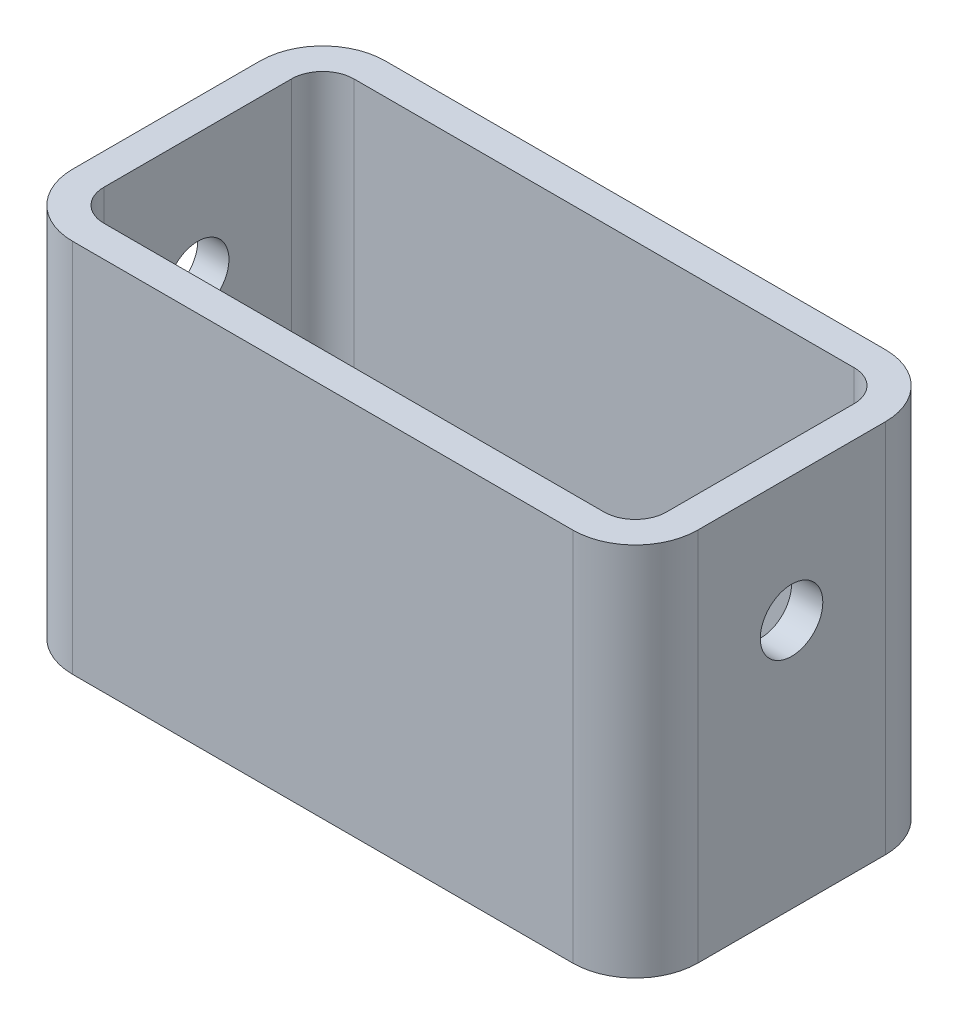
ISO-10303-21;
HEADER;
FILE_DESCRIPTION(('STEP AP214'),'2;1');
FILE_NAME('part.step','',(''),(''),'','','');
FILE_SCHEMA(('AUTOMOTIVE_DESIGN { 1 0 10303 214 1 1 1 1 }'));
ENDSEC;
DATA;
#1=APPLICATION_CONTEXT('core data for automotive mechanical design processes');
#2=APPLICATION_PROTOCOL_DEFINITION('international standard','automotive_design',2000,#1);
#3=PRODUCT_CONTEXT('',#1,'mechanical');
#4=PRODUCT('Part','Part','',(#3));
#5=PRODUCT_RELATED_PRODUCT_CATEGORY('part','',(#4));
#6=PRODUCT_DEFINITION_FORMATION('','',#4);
#7=PRODUCT_DEFINITION_CONTEXT('part definition',#1,'design');
#8=PRODUCT_DEFINITION('design','',#6,#7);
#9=PRODUCT_DEFINITION_SHAPE('','',#8);
#10=(LENGTH_UNIT() NAMED_UNIT(*) SI_UNIT(.MILLI.,.METRE.));
#11=(NAMED_UNIT(*) PLANE_ANGLE_UNIT() SI_UNIT($,.RADIAN.));
#12=(NAMED_UNIT(*) SI_UNIT($,.STERADIAN.) SOLID_ANGLE_UNIT());
#13=UNCERTAINTY_MEASURE_WITH_UNIT(LENGTH_MEASURE(1.E-05),#10,'distance_accuracy_value','');
#14=(GEOMETRIC_REPRESENTATION_CONTEXT(3) GLOBAL_UNCERTAINTY_ASSIGNED_CONTEXT((#13)) GLOBAL_UNIT_ASSIGNED_CONTEXT((#10,
#11,#12)) REPRESENTATION_CONTEXT('',''));
#15=CARTESIAN_POINT('',(0.,0.,0.));
#16=DIRECTION('',(0.,0.,1.));
#17=DIRECTION('',(1.,0.,0.));
#18=AXIS2_PLACEMENT_3D('',#15,#16,#17);
#19=CARTESIAN_POINT('',(-134.464065935856,-62.6480307201147,50.));
#20=DIRECTION('',(0.,-1.,0.));
#21=DIRECTION('',(0.,0.,-1.));
#22=AXIS2_PLACEMENT_3D('',#19,#20,#21);
#23=PLANE('',#22);
#24=DIRECTION('',(0.,0.,-1.));
#25=VECTOR('',#24,1.);
#26=CARTESIAN_POINT('',(-34.4640659358559,-62.6480307201147,50.));
#27=LINE('',#26,#25);
#28=CARTESIAN_POINT('',(-34.4640659358559,-62.6480307201147,40.));
#29=VERTEX_POINT('',#28);
#30=CARTESIAN_POINT('',(-34.4640659358559,-62.6480307201147,10.));
#31=VERTEX_POINT('',#30);
#32=EDGE_CURVE('E227',#29,#31,#27,.T.);
#33=ORIENTED_EDGE('',*,*,#32,.T.);
#34=CARTESIAN_POINT('',(-44.4640659358559,-62.6480307201147,10.));
#35=DIRECTION('',(0.,-1.,0.));
#36=DIRECTION('',(0.,0.,-1.));
#37=AXIS2_PLACEMENT_3D('',#34,#35,#36);
#38=CIRCLE('',#37,10.);
#39=CARTESIAN_POINT('',(-44.4640659358559,-62.6480307201147,0.));
#40=VERTEX_POINT('',#39);
#41=EDGE_CURVE('E247',#31,#40,#38,.F.);
#42=ORIENTED_EDGE('',*,*,#41,.T.);
#43=DIRECTION('',(-1.,0.,0.));
#44=VECTOR('',#43,1.);
#45=CARTESIAN_POINT('',(-134.464065935856,-62.6480307201147,0.));
#46=LINE('',#45,#44);
#47=CARTESIAN_POINT('',(-124.464065935856,-62.6480307201147,0.));
#48=VERTEX_POINT('',#47);
#49=EDGE_CURVE('E217',#40,#48,#46,.T.);
#50=ORIENTED_EDGE('',*,*,#49,.T.);
#51=CARTESIAN_POINT('',(-124.464065935856,-62.6480307201147,10.));
#52=DIRECTION('',(0.,-1.,0.));
#53=DIRECTION('',(0.,0.,-1.));
#54=AXIS2_PLACEMENT_3D('',#51,#52,#53);
#55=CIRCLE('',#54,10.);
#56=CARTESIAN_POINT('',(-134.464065935856,-62.6480307201147,10.));
#57=VERTEX_POINT('',#56);
#58=EDGE_CURVE('E245',#48,#57,#55,.F.);
#59=ORIENTED_EDGE('',*,*,#58,.T.);
#60=DIRECTION('',(0.,0.,-1.));
#61=VECTOR('',#60,1.);
#62=CARTESIAN_POINT('',(-134.464065935856,-62.6480307201147,50.));
#63=LINE('',#62,#61);
#64=CARTESIAN_POINT('',(-134.464065935856,-62.6480307201147,40.));
#65=VERTEX_POINT('',#64);
#66=EDGE_CURVE('E220',#65,#57,#63,.T.);
#67=ORIENTED_EDGE('',*,*,#66,.F.);
#68=CARTESIAN_POINT('',(-124.464065935856,-62.6480307201147,40.));
#69=DIRECTION('',(0.,-1.,0.));
#70=DIRECTION('',(0.,0.,-1.));
#71=AXIS2_PLACEMENT_3D('',#68,#69,#70);
#72=CIRCLE('',#71,10.);
#73=CARTESIAN_POINT('',(-124.464065935856,-62.6480307201147,50.));
#74=VERTEX_POINT('',#73);
#75=EDGE_CURVE('E243',#65,#74,#72,.F.);
#76=ORIENTED_EDGE('',*,*,#75,.T.);
#77=DIRECTION('',(-1.,0.,0.));
#78=VECTOR('',#77,1.);
#79=CARTESIAN_POINT('',(-134.464065935856,-62.6480307201147,50.));
#80=LINE('',#79,#78);
#81=CARTESIAN_POINT('',(-44.4640659358559,-62.6480307201147,50.));
#82=VERTEX_POINT('',#81);
#83=EDGE_CURVE('E216',#82,#74,#80,.T.);
#84=ORIENTED_EDGE('',*,*,#83,.F.);
#85=CARTESIAN_POINT('',(-44.4640659358559,-62.6480307201147,40.));
#86=DIRECTION('',(0.,-1.,0.));
#87=DIRECTION('',(0.,0.,-1.));
#88=AXIS2_PLACEMENT_3D('',#85,#86,#87);
#89=CIRCLE('',#88,10.);
#90=EDGE_CURVE('E241',#82,#29,#89,.F.);
#91=ORIENTED_EDGE('',*,*,#90,.T.);
#92=EDGE_LOOP('',(#33,#42,#50,#59,#67,#76,#84,#91));
#93=FACE_BOUND('',#92,.T.);
#94=DIRECTION('',(0.,0.,-1.));
#95=VECTOR('',#94,1.);
#96=CARTESIAN_POINT('',(-39.4640659358559,-62.6480307201147,50.));
#97=LINE('',#96,#95);
#98=CARTESIAN_POINT('',(-39.4640659358559,-62.6480307201147,40.));
#99=VERTEX_POINT('',#98);
#100=CARTESIAN_POINT('',(-39.4640659358559,-62.6480307201147,10.));
#101=VERTEX_POINT('',#100);
#102=EDGE_CURVE('E174',#99,#101,#97,.T.);
#103=ORIENTED_EDGE('',*,*,#102,.F.);
#104=CARTESIAN_POINT('',(-44.4640659358559,-62.6480307201147,40.));
#105=DIRECTION('',(0.,-1.,0.));
#106=DIRECTION('',(0.,0.,-1.));
#107=AXIS2_PLACEMENT_3D('',#104,#105,#106);
#108=CIRCLE('',#107,5.);
#109=CARTESIAN_POINT('',(-44.4640659358559,-62.6480307201147,45.));
#110=VERTEX_POINT('',#109);
#111=EDGE_CURVE('E179',#110,#99,#108,.F.);
#112=ORIENTED_EDGE('',*,*,#111,.F.);
#113=DIRECTION('',(-1.,0.,0.));
#114=VECTOR('',#113,1.);
#115=CARTESIAN_POINT('',(-134.464065935856,-62.6480307201147,45.));
#116=LINE('',#115,#114);
#117=CARTESIAN_POINT('',(-124.464065935856,-62.6480307201147,45.));
#118=VERTEX_POINT('',#117);
#119=EDGE_CURVE('E51',#110,#118,#116,.T.);
#120=ORIENTED_EDGE('',*,*,#119,.T.);
#121=CARTESIAN_POINT('',(-124.464065935856,-62.6480307201147,40.));
#122=DIRECTION('',(0.,-1.,0.));
#123=DIRECTION('',(0.,0.,-1.));
#124=AXIS2_PLACEMENT_3D('',#121,#122,#123);
#125=CIRCLE('',#124,5.);
#126=CARTESIAN_POINT('',(-129.464065935856,-62.6480307201147,40.));
#127=VERTEX_POINT('',#126);
#128=EDGE_CURVE('E182',#127,#118,#125,.F.);
#129=ORIENTED_EDGE('',*,*,#128,.F.);
#130=DIRECTION('',(0.,0.,-1.));
#131=VECTOR('',#130,1.);
#132=CARTESIAN_POINT('',(-129.464065935856,-62.6480307201147,50.));
#133=LINE('',#132,#131);
#134=CARTESIAN_POINT('',(-129.464065935856,-62.6480307201147,10.));
#135=VERTEX_POINT('',#134);
#136=EDGE_CURVE('E199',#127,#135,#133,.T.);
#137=ORIENTED_EDGE('',*,*,#136,.T.);
#138=CARTESIAN_POINT('',(-124.464065935856,-62.6480307201147,10.));
#139=DIRECTION('',(0.,-1.,0.));
#140=DIRECTION('',(0.,0.,-1.));
#141=AXIS2_PLACEMENT_3D('',#138,#139,#140);
#142=CIRCLE('',#141,5.);
#143=CARTESIAN_POINT('',(-124.464065935856,-62.6480307201147,5.));
#144=VERTEX_POINT('',#143);
#145=EDGE_CURVE('E203',#144,#135,#142,.F.);
#146=ORIENTED_EDGE('',*,*,#145,.F.);
#147=DIRECTION('',(-1.,0.,0.));
#148=VECTOR('',#147,1.);
#149=CARTESIAN_POINT('',(-134.464065935856,-62.6480307201147,5.));
#150=LINE('',#149,#148);
#151=CARTESIAN_POINT('',(-44.4640659358559,-62.6480307201147,5.));
#152=VERTEX_POINT('',#151);
#153=EDGE_CURVE('E208',#152,#144,#150,.T.);
#154=ORIENTED_EDGE('',*,*,#153,.F.);
#155=CARTESIAN_POINT('',(-44.4640659358559,-62.6480307201147,10.));
#156=DIRECTION('',(0.,-1.,0.));
#157=DIRECTION('',(0.,0.,-1.));
#158=AXIS2_PLACEMENT_3D('',#155,#156,#157);
#159=CIRCLE('',#158,5.);
#160=EDGE_CURVE('E191',#101,#152,#159,.F.);
#161=ORIENTED_EDGE('',*,*,#160,.F.);
#162=EDGE_LOOP('',(#103,#112,#120,#129,#137,#146,#154,#161));
#163=FACE_BOUND('',#162,.T.);
#164=ADVANCED_FACE('F35',(#93,#163),#23,.F.);
#165=CARTESIAN_POINT('',(-134.464065935856,-122.648030720115,50.));
#166=DIRECTION('',(1.,0.,0.));
#167=DIRECTION('',(0.,0.,-1.));
#168=AXIS2_PLACEMENT_3D('',#165,#166,#167);
#169=PLANE('',#168);
#170=CARTESIAN_POINT('',(-134.464065935856,-82.6480307201147,25.));
#171=DIRECTION('',(1.,0.,0.));
#172=DIRECTION('',(0.,0.,-1.));
#173=AXIS2_PLACEMENT_3D('',#170,#171,#172);
#174=CIRCLE('',#173,5.);
#175=CARTESIAN_POINT('',(-134.464065935856,-82.6480307201147,20.));
#176=VERTEX_POINT('',#175);
#177=EDGE_CURVE('E370',#176,#176,#174,.T.);
#178=ORIENTED_EDGE('',*,*,#177,.T.);
#179=EDGE_LOOP('',(#178));
#180=FACE_BOUND('',#179,.T.);
#181=ORIENTED_EDGE('',*,*,#66,.T.);
#182=DIRECTION('',(0.,-1.,0.));
#183=VECTOR('',#182,1.);
#184=CARTESIAN_POINT('',(-134.464065935856,-122.648030720115,10.));
#185=LINE('',#184,#183);
#186=CARTESIAN_POINT('',(-134.464065935856,-122.648030720115,10.));
#187=VERTEX_POINT('',#186);
#188=EDGE_CURVE('E262',#57,#187,#185,.T.);
#189=ORIENTED_EDGE('',*,*,#188,.T.);
#190=DIRECTION('',(0.,0.,-1.));
#191=VECTOR('',#190,1.);
#192=CARTESIAN_POINT('',(-134.464065935856,-122.648030720115,50.));
#193=LINE('',#192,#191);
#194=CARTESIAN_POINT('',(-134.464065935856,-122.648030720115,40.));
#195=VERTEX_POINT('',#194);
#196=EDGE_CURVE('E233',#195,#187,#193,.T.);
#197=ORIENTED_EDGE('',*,*,#196,.F.);
#198=DIRECTION('',(0.,-1.,0.));
#199=VECTOR('',#198,1.);
#200=CARTESIAN_POINT('',(-134.464065935856,-122.648030720115,40.));
#201=LINE('',#200,#199);
#202=EDGE_CURVE('E260',#195,#65,#201,.F.);
#203=ORIENTED_EDGE('',*,*,#202,.T.);
#204=EDGE_LOOP('',(#181,#189,#197,#203));
#205=FACE_BOUND('',#204,.T.);
#206=ADVANCED_FACE('F300',(#180,#205),#169,.F.);
#207=CARTESIAN_POINT('',(-134.464065935856,-122.648030720115,50.));
#208=DIRECTION('',(0.,1.,0.));
#209=DIRECTION('',(0.,0.,1.));
#210=AXIS2_PLACEMENT_3D('',#207,#208,#209);
#211=PLANE('',#210);
#212=DIRECTION('',(1.,0.,0.));
#213=VECTOR('',#212,1.);
#214=CARTESIAN_POINT('',(-134.464065935856,-122.648030720115,0.));
#215=LINE('',#214,#213);
#216=CARTESIAN_POINT('',(-124.464065935856,-122.648030720115,0.));
#217=VERTEX_POINT('',#216);
#218=CARTESIAN_POINT('',(-44.4640659358559,-122.648030720115,0.));
#219=VERTEX_POINT('',#218);
#220=EDGE_CURVE('E198',#217,#219,#215,.T.);
#221=ORIENTED_EDGE('',*,*,#220,.T.);
#222=CARTESIAN_POINT('',(-44.4640659358559,-122.648030720115,10.));
#223=DIRECTION('',(0.,1.,0.));
#224=DIRECTION('',(0.,0.,1.));
#225=AXIS2_PLACEMENT_3D('',#222,#223,#224);
#226=CIRCLE('',#225,10.);
#227=CARTESIAN_POINT('',(-34.4640659358559,-122.648030720115,10.));
#228=VERTEX_POINT('',#227);
#229=EDGE_CURVE('E258',#219,#228,#226,.F.);
#230=ORIENTED_EDGE('',*,*,#229,.T.);
#231=DIRECTION('',(0.,0.,-1.));
#232=VECTOR('',#231,1.);
#233=CARTESIAN_POINT('',(-34.4640659358559,-122.648030720115,50.));
#234=LINE('',#233,#232);
#235=CARTESIAN_POINT('',(-34.4640659358559,-122.648030720115,40.));
#236=VERTEX_POINT('',#235);
#237=EDGE_CURVE('E230',#236,#228,#234,.T.);
#238=ORIENTED_EDGE('',*,*,#237,.F.);
#239=CARTESIAN_POINT('',(-44.4640659358559,-122.648030720115,40.));
#240=DIRECTION('',(0.,1.,0.));
#241=DIRECTION('',(0.,0.,1.));
#242=AXIS2_PLACEMENT_3D('',#239,#240,#241);
#243=CIRCLE('',#242,10.);
#244=CARTESIAN_POINT('',(-44.4640659358559,-122.648030720115,50.));
#245=VERTEX_POINT('',#244);
#246=EDGE_CURVE('E253',#236,#245,#243,.F.);
#247=ORIENTED_EDGE('',*,*,#246,.T.);
#248=DIRECTION('',(1.,0.,0.));
#249=VECTOR('',#248,1.);
#250=CARTESIAN_POINT('',(-134.464065935856,-122.648030720115,50.));
#251=LINE('',#250,#249);
#252=CARTESIAN_POINT('',(-124.464065935856,-122.648030720115,50.));
#253=VERTEX_POINT('',#252);
#254=EDGE_CURVE('E213',#253,#245,#251,.T.);
#255=ORIENTED_EDGE('',*,*,#254,.F.);
#256=CARTESIAN_POINT('',(-124.464065935856,-122.648030720115,40.));
#257=DIRECTION('',(0.,1.,0.));
#258=DIRECTION('',(0.,0.,1.));
#259=AXIS2_PLACEMENT_3D('',#256,#257,#258);
#260=CIRCLE('',#259,10.);
#261=EDGE_CURVE('E255',#253,#195,#260,.F.);
#262=ORIENTED_EDGE('',*,*,#261,.T.);
#263=ORIENTED_EDGE('',*,*,#196,.T.);
#264=CARTESIAN_POINT('',(-124.464065935856,-122.648030720115,10.));
#265=DIRECTION('',(0.,1.,0.));
#266=DIRECTION('',(0.,0.,1.));
#267=AXIS2_PLACEMENT_3D('',#264,#265,#266);
#268=CIRCLE('',#267,10.);
#269=EDGE_CURVE('E59',#187,#217,#268,.F.);
#270=ORIENTED_EDGE('',*,*,#269,.T.);
#271=EDGE_LOOP('',(#221,#230,#238,#247,#255,#262,#263,#270));
#272=FACE_BOUND('',#271,.T.);
#273=ADVANCED_FACE('F282',(#272),#211,.F.);
#274=CARTESIAN_POINT('',(-34.4640659358559,-122.648030720115,50.));
#275=DIRECTION('',(-1.,0.,0.));
#276=DIRECTION('',(0.,0.,1.));
#277=AXIS2_PLACEMENT_3D('',#274,#275,#276);
#278=PLANE('',#277);
#279=CARTESIAN_POINT('',(-34.4640659358559,-82.6480307201147,25.));
#280=DIRECTION('',(1.,0.,0.));
#281=DIRECTION('',(0.,0.,-1.));
#282=AXIS2_PLACEMENT_3D('',#279,#280,#281);
#283=CIRCLE('',#282,5.);
#284=CARTESIAN_POINT('',(-34.4640659358559,-82.6480307201147,20.));
#285=VERTEX_POINT('',#284);
#286=EDGE_CURVE('E368',#285,#285,#283,.T.);
#287=ORIENTED_EDGE('',*,*,#286,.F.);
#288=EDGE_LOOP('',(#287));
#289=FACE_BOUND('',#288,.T.);
#290=ORIENTED_EDGE('',*,*,#237,.T.);
#291=DIRECTION('',(0.,1.,0.));
#292=VECTOR('',#291,1.);
#293=CARTESIAN_POINT('',(-34.4640659358559,-62.6480307201147,10.));
#294=LINE('',#293,#292);
#295=EDGE_CURVE('E238',#228,#31,#294,.T.);
#296=ORIENTED_EDGE('',*,*,#295,.T.);
#297=ORIENTED_EDGE('',*,*,#32,.F.);
#298=DIRECTION('',(0.,1.,0.));
#299=VECTOR('',#298,1.);
#300=CARTESIAN_POINT('',(-34.4640659358559,-122.648030720115,40.));
#301=LINE('',#300,#299);
#302=EDGE_CURVE('E236',#29,#236,#301,.F.);
#303=ORIENTED_EDGE('',*,*,#302,.T.);
#304=EDGE_LOOP('',(#290,#296,#297,#303));
#305=FACE_BOUND('',#304,.T.);
#306=ADVANCED_FACE('F287',(#289,#305),#278,.F.);
#307=CARTESIAN_POINT('',(-134.464065935856,-62.6480307201147,50.));
#308=DIRECTION('',(0.,0.,-1.));
#309=DIRECTION('',(-1.,0.,0.));
#310=AXIS2_PLACEMENT_3D('',#307,#308,#309);
#311=PLANE('',#310);
#312=ORIENTED_EDGE('',*,*,#83,.T.);
#313=DIRECTION('',(0.,-1.,0.));
#314=VECTOR('',#313,1.);
#315=CARTESIAN_POINT('',(-124.464065935856,-62.6480307201147,50.));
#316=LINE('',#315,#314);
#317=EDGE_CURVE('E11',#74,#253,#316,.T.);
#318=ORIENTED_EDGE('',*,*,#317,.T.);
#319=ORIENTED_EDGE('',*,*,#254,.T.);
#320=DIRECTION('',(0.,1.,0.));
#321=VECTOR('',#320,1.);
#322=CARTESIAN_POINT('',(-44.4640659358559,-62.6480307201147,50.));
#323=LINE('',#322,#321);
#324=EDGE_CURVE('E44',#245,#82,#323,.T.);
#325=ORIENTED_EDGE('',*,*,#324,.T.);
#326=EDGE_LOOP('',(#312,#318,#319,#325));
#327=FACE_BOUND('',#326,.T.);
#328=ADVANCED_FACE('F268',(#327),#311,.F.);
#329=CARTESIAN_POINT('',(-134.464065935856,-62.6480307201147,0.));
#330=DIRECTION('',(0.,0.,-1.));
#331=DIRECTION('',(-1.,0.,0.));
#332=AXIS2_PLACEMENT_3D('',#329,#330,#331);
#333=PLANE('',#332);
#334=ORIENTED_EDGE('',*,*,#49,.F.);
#335=DIRECTION('',(0.,1.,0.));
#336=VECTOR('',#335,1.);
#337=CARTESIAN_POINT('',(-44.4640659358559,-122.648030720115,0.));
#338=LINE('',#337,#336);
#339=EDGE_CURVE('E251',#40,#219,#338,.F.);
#340=ORIENTED_EDGE('',*,*,#339,.T.);
#341=ORIENTED_EDGE('',*,*,#220,.F.);
#342=DIRECTION('',(0.,-1.,0.));
#343=VECTOR('',#342,1.);
#344=CARTESIAN_POINT('',(-124.464065935856,-62.6480307201147,0.));
#345=LINE('',#344,#343);
#346=EDGE_CURVE('E249',#217,#48,#345,.F.);
#347=ORIENTED_EDGE('',*,*,#346,.T.);
#348=EDGE_LOOP('',(#334,#340,#341,#347));
#349=FACE_BOUND('',#348,.T.);
#350=ADVANCED_FACE('F294',(#349),#333,.T.);
#351=CARTESIAN_POINT('',(-44.4640659358559,-122.648030720115,10.));
#352=DIRECTION('',(0.,-1.,0.));
#353=DIRECTION('',(0.,0.,-1.));
#354=AXIS2_PLACEMENT_3D('',#351,#352,#353);
#355=CYLINDRICAL_SURFACE('',#354,10.);
#356=ORIENTED_EDGE('',*,*,#229,.F.);
#357=ORIENTED_EDGE('',*,*,#339,.F.);
#358=ORIENTED_EDGE('',*,*,#41,.F.);
#359=ORIENTED_EDGE('',*,*,#295,.F.);
#360=EDGE_LOOP('',(#356,#357,#358,#359));
#361=FACE_BOUND('',#360,.T.);
#362=ADVANCED_FACE('F297',(#361),#355,.T.);
#363=CARTESIAN_POINT('',(-124.464065935856,-122.648030720115,10.));
#364=DIRECTION('',(0.,1.,0.));
#365=DIRECTION('',(0.,0.,1.));
#366=AXIS2_PLACEMENT_3D('',#363,#364,#365);
#367=CYLINDRICAL_SURFACE('',#366,10.);
#368=ORIENTED_EDGE('',*,*,#58,.F.);
#369=ORIENTED_EDGE('',*,*,#346,.F.);
#370=ORIENTED_EDGE('',*,*,#269,.F.);
#371=ORIENTED_EDGE('',*,*,#188,.F.);
#372=EDGE_LOOP('',(#368,#369,#370,#371));
#373=FACE_BOUND('',#372,.T.);
#374=ADVANCED_FACE('F298',(#373),#367,.T.);
#375=CARTESIAN_POINT('',(-124.464065935856,-62.6480307201147,40.));
#376=DIRECTION('',(0.,-1.,0.));
#377=DIRECTION('',(0.,0.,-1.));
#378=AXIS2_PLACEMENT_3D('',#375,#376,#377);
#379=CYLINDRICAL_SURFACE('',#378,10.);
#380=ORIENTED_EDGE('',*,*,#75,.F.);
#381=ORIENTED_EDGE('',*,*,#202,.F.);
#382=ORIENTED_EDGE('',*,*,#261,.F.);
#383=ORIENTED_EDGE('',*,*,#317,.F.);
#384=EDGE_LOOP('',(#380,#381,#382,#383));
#385=FACE_BOUND('',#384,.T.);
#386=ADVANCED_FACE('F280',(#385),#379,.T.);
#387=CARTESIAN_POINT('',(-44.4640659358559,-62.6480307201147,40.));
#388=DIRECTION('',(0.,1.,0.));
#389=DIRECTION('',(0.,0.,1.));
#390=AXIS2_PLACEMENT_3D('',#387,#388,#389);
#391=CYLINDRICAL_SURFACE('',#390,10.);
#392=ORIENTED_EDGE('',*,*,#246,.F.);
#393=ORIENTED_EDGE('',*,*,#302,.F.);
#394=ORIENTED_EDGE('',*,*,#90,.F.);
#395=ORIENTED_EDGE('',*,*,#324,.F.);
#396=EDGE_LOOP('',(#392,#393,#394,#395));
#397=FACE_BOUND('',#396,.T.);
#398=ADVANCED_FACE('F37',(#397),#391,.T.);
#399=CARTESIAN_POINT('',(-129.464065935856,-122.648030720115,50.));
#400=DIRECTION('',(1.,0.,0.));
#401=DIRECTION('',(0.,0.,-1.));
#402=AXIS2_PLACEMENT_3D('',#399,#400,#401);
#403=PLANE('',#402);
#404=CARTESIAN_POINT('',(-129.464065935856,-82.6480307201147,25.));
#405=DIRECTION('',(1.,0.,0.));
#406=DIRECTION('',(0.,0.,-1.));
#407=AXIS2_PLACEMENT_3D('',#404,#405,#406);
#408=CIRCLE('',#407,5.);
#409=CARTESIAN_POINT('',(-129.464065935856,-82.6480307201147,20.));
#410=VERTEX_POINT('',#409);
#411=EDGE_CURVE('E374',#410,#410,#408,.T.);
#412=ORIENTED_EDGE('',*,*,#411,.F.);
#413=EDGE_LOOP('',(#412));
#414=FACE_BOUND('',#413,.T.);
#415=ORIENTED_EDGE('',*,*,#136,.F.);
#416=DIRECTION('',(0.,1.,0.));
#417=VECTOR('',#416,1.);
#418=CARTESIAN_POINT('',(-129.464065935856,-122.648030720115,40.));
#419=LINE('',#418,#417);
#420=CARTESIAN_POINT('',(-129.464065935856,-117.648030720115,40.));
#421=VERTEX_POINT('',#420);
#422=EDGE_CURVE('E162',#421,#127,#419,.T.);
#423=ORIENTED_EDGE('',*,*,#422,.F.);
#424=DIRECTION('',(0.,0.,-1.));
#425=VECTOR('',#424,1.);
#426=CARTESIAN_POINT('',(-129.464065935856,-117.648030720115,50.));
#427=LINE('',#426,#425);
#428=CARTESIAN_POINT('',(-129.464065935856,-117.648030720115,10.));
#429=VERTEX_POINT('',#428);
#430=EDGE_CURVE('E173',#421,#429,#427,.T.);
#431=ORIENTED_EDGE('',*,*,#430,.T.);
#432=DIRECTION('',(0.,1.,0.));
#433=VECTOR('',#432,1.);
#434=CARTESIAN_POINT('',(-129.464065935856,-122.648030720115,10.));
#435=LINE('',#434,#433);
#436=EDGE_CURVE('E195',#135,#429,#435,.F.);
#437=ORIENTED_EDGE('',*,*,#436,.F.);
#438=EDGE_LOOP('',(#415,#423,#431,#437));
#439=FACE_BOUND('',#438,.T.);
#440=ADVANCED_FACE('F320',(#414,#439),#403,.T.);
#441=CARTESIAN_POINT('',(-134.464065935856,-117.648030720115,50.));
#442=DIRECTION('',(0.,1.,0.));
#443=DIRECTION('',(0.,0.,1.));
#444=AXIS2_PLACEMENT_3D('',#441,#442,#443);
#445=PLANE('',#444);
#446=DIRECTION('',(1.,0.,0.));
#447=VECTOR('',#446,1.);
#448=CARTESIAN_POINT('',(-134.464065935856,-117.648030720115,5.));
#449=LINE('',#448,#447);
#450=CARTESIAN_POINT('',(-124.464065935856,-117.648030720115,5.));
#451=VERTEX_POINT('',#450);
#452=CARTESIAN_POINT('',(-44.4640659358559,-117.648030720115,5.));
#453=VERTEX_POINT('',#452);
#454=EDGE_CURVE('E211',#451,#453,#449,.T.);
#455=ORIENTED_EDGE('',*,*,#454,.F.);
#456=CARTESIAN_POINT('',(-124.464065935856,-117.648030720115,10.));
#457=DIRECTION('',(0.,1.,0.));
#458=DIRECTION('',(0.,0.,1.));
#459=AXIS2_PLACEMENT_3D('',#456,#457,#458);
#460=CIRCLE('',#459,5.);
#461=EDGE_CURVE('E163',#429,#451,#460,.F.);
#462=ORIENTED_EDGE('',*,*,#461,.F.);
#463=ORIENTED_EDGE('',*,*,#430,.F.);
#464=CARTESIAN_POINT('',(-124.464065935856,-117.648030720115,40.));
#465=DIRECTION('',(0.,1.,0.));
#466=DIRECTION('',(0.,0.,1.));
#467=AXIS2_PLACEMENT_3D('',#464,#465,#466);
#468=CIRCLE('',#467,5.);
#469=CARTESIAN_POINT('',(-124.464065935856,-117.648030720115,45.));
#470=VERTEX_POINT('',#469);
#471=EDGE_CURVE('E384',#470,#421,#468,.F.);
#472=ORIENTED_EDGE('',*,*,#471,.F.);
#473=DIRECTION('',(1.,0.,0.));
#474=VECTOR('',#473,1.);
#475=CARTESIAN_POINT('',(-134.464065935856,-117.648030720115,45.));
#476=LINE('',#475,#474);
#477=CARTESIAN_POINT('',(-44.4640659358559,-117.648030720115,45.));
#478=VERTEX_POINT('',#477);
#479=EDGE_CURVE('E204',#470,#478,#476,.T.);
#480=ORIENTED_EDGE('',*,*,#479,.T.);
#481=CARTESIAN_POINT('',(-44.4640659358559,-117.648030720115,40.));
#482=DIRECTION('',(0.,1.,0.));
#483=DIRECTION('',(0.,0.,1.));
#484=AXIS2_PLACEMENT_3D('',#481,#482,#483);
#485=CIRCLE('',#484,5.);
#486=CARTESIAN_POINT('',(-39.4640659358559,-117.648030720115,40.));
#487=VERTEX_POINT('',#486);
#488=EDGE_CURVE('E170',#487,#478,#485,.F.);
#489=ORIENTED_EDGE('',*,*,#488,.F.);
#490=DIRECTION('',(0.,0.,-1.));
#491=VECTOR('',#490,1.);
#492=CARTESIAN_POINT('',(-39.4640659358559,-117.648030720115,50.));
#493=LINE('',#492,#491);
#494=CARTESIAN_POINT('',(-39.4640659358559,-117.648030720115,10.));
#495=VERTEX_POINT('',#494);
#496=EDGE_CURVE('E167',#487,#495,#493,.T.);
#497=ORIENTED_EDGE('',*,*,#496,.T.);
#498=CARTESIAN_POINT('',(-44.4640659358559,-117.648030720115,10.));
#499=DIRECTION('',(0.,1.,0.));
#500=DIRECTION('',(0.,0.,1.));
#501=AXIS2_PLACEMENT_3D('',#498,#499,#500);
#502=CIRCLE('',#501,5.);
#503=EDGE_CURVE('E151',#453,#495,#502,.F.);
#504=ORIENTED_EDGE('',*,*,#503,.F.);
#505=EDGE_LOOP('',(#455,#462,#463,#472,#480,#489,#497,#504));
#506=FACE_BOUND('',#505,.T.);
#507=ADVANCED_FACE('F168',(#506),#445,.T.);
#508=CARTESIAN_POINT('',(-39.4640659358559,-122.648030720115,50.));
#509=DIRECTION('',(-1.,0.,0.));
#510=DIRECTION('',(0.,0.,1.));
#511=AXIS2_PLACEMENT_3D('',#508,#509,#510);
#512=PLANE('',#511);
#513=CARTESIAN_POINT('',(-39.4640659358559,-82.6480307201147,25.));
#514=DIRECTION('',(-1.,0.,0.));
#515=DIRECTION('',(0.,0.,1.));
#516=AXIS2_PLACEMENT_3D('',#513,#514,#515);
#517=CIRCLE('',#516,5.);
#518=CARTESIAN_POINT('',(-39.4640659358559,-82.6480307201147,30.));
#519=VERTEX_POINT('',#518);
#520=EDGE_CURVE('E39',#519,#519,#517,.T.);
#521=ORIENTED_EDGE('',*,*,#520,.F.);
#522=EDGE_LOOP('',(#521));
#523=FACE_BOUND('',#522,.T.);
#524=ORIENTED_EDGE('',*,*,#496,.F.);
#525=DIRECTION('',(0.,1.,0.));
#526=VECTOR('',#525,1.);
#527=CARTESIAN_POINT('',(-39.4640659358559,-122.648030720115,40.));
#528=LINE('',#527,#526);
#529=EDGE_CURVE('E180',#99,#487,#528,.F.);
#530=ORIENTED_EDGE('',*,*,#529,.F.);
#531=ORIENTED_EDGE('',*,*,#102,.T.);
#532=DIRECTION('',(0.,1.,0.));
#533=VECTOR('',#532,1.);
#534=CARTESIAN_POINT('',(-39.4640659358559,-122.648030720115,10.));
#535=LINE('',#534,#533);
#536=EDGE_CURVE('E155',#495,#101,#535,.T.);
#537=ORIENTED_EDGE('',*,*,#536,.F.);
#538=EDGE_LOOP('',(#524,#530,#531,#537));
#539=FACE_BOUND('',#538,.T.);
#540=ADVANCED_FACE('F176',(#523,#539),#512,.T.);
#541=CARTESIAN_POINT('',(-134.464065935856,-62.6480307201147,45.));
#542=DIRECTION('',(0.,0.,-1.));
#543=DIRECTION('',(-1.,0.,0.));
#544=AXIS2_PLACEMENT_3D('',#541,#542,#543);
#545=PLANE('',#544);
#546=ORIENTED_EDGE('',*,*,#119,.F.);
#547=DIRECTION('',(0.,1.,0.));
#548=VECTOR('',#547,1.);
#549=CARTESIAN_POINT('',(-44.4640659358559,-62.6480307201147,45.));
#550=LINE('',#549,#548);
#551=EDGE_CURVE('E192',#478,#110,#550,.T.);
#552=ORIENTED_EDGE('',*,*,#551,.F.);
#553=ORIENTED_EDGE('',*,*,#479,.F.);
#554=DIRECTION('',(0.,1.,0.));
#555=VECTOR('',#554,1.);
#556=CARTESIAN_POINT('',(-124.464065935856,-62.6480307201147,45.));
#557=LINE('',#556,#555);
#558=EDGE_CURVE('E194',#118,#470,#557,.F.);
#559=ORIENTED_EDGE('',*,*,#558,.F.);
#560=EDGE_LOOP('',(#546,#552,#553,#559));
#561=FACE_BOUND('',#560,.T.);
#562=ADVANCED_FACE('F337',(#561),#545,.T.);
#563=CARTESIAN_POINT('',(-134.464065935856,-62.6480307201147,5.));
#564=DIRECTION('',(0.,0.,-1.));
#565=DIRECTION('',(-1.,0.,0.));
#566=AXIS2_PLACEMENT_3D('',#563,#564,#565);
#567=PLANE('',#566);
#568=ORIENTED_EDGE('',*,*,#153,.T.);
#569=DIRECTION('',(0.,1.,0.));
#570=VECTOR('',#569,1.);
#571=CARTESIAN_POINT('',(-124.464065935856,-62.6480307201147,5.));
#572=LINE('',#571,#570);
#573=EDGE_CURVE('E189',#451,#144,#572,.T.);
#574=ORIENTED_EDGE('',*,*,#573,.F.);
#575=ORIENTED_EDGE('',*,*,#454,.T.);
#576=DIRECTION('',(0.,1.,0.));
#577=VECTOR('',#576,1.);
#578=CARTESIAN_POINT('',(-44.4640659358559,-62.6480307201147,5.));
#579=LINE('',#578,#577);
#580=EDGE_CURVE('E158',#152,#453,#579,.F.);
#581=ORIENTED_EDGE('',*,*,#580,.F.);
#582=EDGE_LOOP('',(#568,#574,#575,#581));
#583=FACE_BOUND('',#582,.T.);
#584=ADVANCED_FACE('F341',(#583),#567,.F.);
#585=CARTESIAN_POINT('',(-44.4640659358559,-122.648030720115,10.));
#586=DIRECTION('',(0.,-1.,0.));
#587=DIRECTION('',(0.,0.,-1.));
#588=AXIS2_PLACEMENT_3D('',#585,#586,#587);
#589=CYLINDRICAL_SURFACE('',#588,5.);
#590=ORIENTED_EDGE('',*,*,#503,.T.);
#591=ORIENTED_EDGE('',*,*,#536,.T.);
#592=ORIENTED_EDGE('',*,*,#160,.T.);
#593=ORIENTED_EDGE('',*,*,#580,.T.);
#594=EDGE_LOOP('',(#590,#591,#592,#593));
#595=FACE_BOUND('',#594,.T.);
#596=ADVANCED_FACE('F153',(#595),#589,.F.);
#597=CARTESIAN_POINT('',(-124.464065935856,-122.648030720115,10.));
#598=DIRECTION('',(0.,1.,0.));
#599=DIRECTION('',(0.,0.,1.));
#600=AXIS2_PLACEMENT_3D('',#597,#598,#599);
#601=CYLINDRICAL_SURFACE('',#600,5.);
#602=ORIENTED_EDGE('',*,*,#145,.T.);
#603=ORIENTED_EDGE('',*,*,#436,.T.);
#604=ORIENTED_EDGE('',*,*,#461,.T.);
#605=ORIENTED_EDGE('',*,*,#573,.T.);
#606=EDGE_LOOP('',(#602,#603,#604,#605));
#607=FACE_BOUND('',#606,.T.);
#608=ADVANCED_FACE('F347',(#607),#601,.F.);
#609=CARTESIAN_POINT('',(-124.464065935856,-62.6480307201147,40.));
#610=DIRECTION('',(0.,-1.,0.));
#611=DIRECTION('',(0.,0.,-1.));
#612=AXIS2_PLACEMENT_3D('',#609,#610,#611);
#613=CYLINDRICAL_SURFACE('',#612,5.);
#614=ORIENTED_EDGE('',*,*,#128,.T.);
#615=ORIENTED_EDGE('',*,*,#558,.T.);
#616=ORIENTED_EDGE('',*,*,#471,.T.);
#617=ORIENTED_EDGE('',*,*,#422,.T.);
#618=EDGE_LOOP('',(#614,#615,#616,#617));
#619=FACE_BOUND('',#618,.T.);
#620=ADVANCED_FACE('F350',(#619),#613,.F.);
#621=CARTESIAN_POINT('',(-44.4640659358559,-62.6480307201147,40.));
#622=DIRECTION('',(0.,1.,0.));
#623=DIRECTION('',(0.,0.,1.));
#624=AXIS2_PLACEMENT_3D('',#621,#622,#623);
#625=CYLINDRICAL_SURFACE('',#624,5.);
#626=ORIENTED_EDGE('',*,*,#488,.T.);
#627=ORIENTED_EDGE('',*,*,#551,.T.);
#628=ORIENTED_EDGE('',*,*,#111,.T.);
#629=ORIENTED_EDGE('',*,*,#529,.T.);
#630=EDGE_LOOP('',(#626,#627,#628,#629));
#631=FACE_BOUND('',#630,.T.);
#632=ADVANCED_FACE('F354',(#631),#625,.F.);
#633=CARTESIAN_POINT('',(-134.464065935856,-82.6480307201147,25.));
#634=DIRECTION('',(1.,0.,0.));
#635=DIRECTION('',(0.,0.,-1.));
#636=AXIS2_PLACEMENT_3D('',#633,#634,#635);
#637=CYLINDRICAL_SURFACE('',#636,5.);
#638=ORIENTED_EDGE('',*,*,#520,.T.);
#639=EDGE_LOOP('',(#638));
#640=FACE_BOUND('',#639,.T.);
#641=ORIENTED_EDGE('',*,*,#286,.T.);
#642=EDGE_LOOP('',(#641));
#643=FACE_BOUND('',#642,.T.);
#644=ADVANCED_FACE('F333',(#640,#643),#637,.F.);
#645=ORIENTED_EDGE('',*,*,#411,.T.);
#646=EDGE_LOOP('',(#645));
#647=FACE_BOUND('',#646,.T.);
#648=ORIENTED_EDGE('',*,*,#177,.F.);
#649=EDGE_LOOP('',(#648));
#650=FACE_BOUND('',#649,.T.);
#651=ADVANCED_FACE('F400',(#647,#650),#637,.F.);
#652=CLOSED_SHELL('',(#164,#206,#273,#306,#328,#350,#362,#374,#386,#398,#440,#507,#540,#562,
#584,#596,#608,#620,#632,#644,#651));
#653=MANIFOLD_SOLID_BREP('B2',#652);
#654=ADVANCED_BREP_SHAPE_REPRESENTATION('',(#18,#653),#14);
#655=SHAPE_DEFINITION_REPRESENTATION(#9,#654);
ENDSEC;
END-ISO-10303-21;
